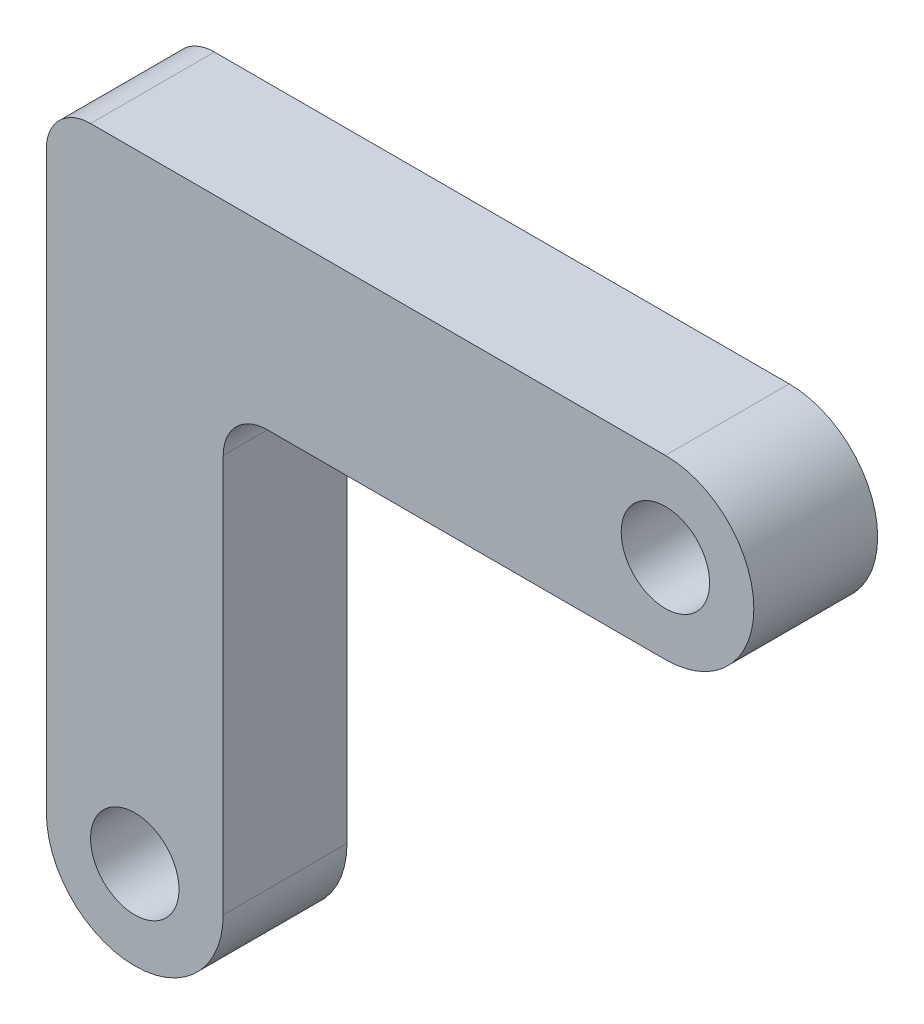
ISO-10303-21;
HEADER;
FILE_DESCRIPTION(('STEP AP214'),'2;1');
FILE_NAME('part.step','',(''),(''),'','','');
FILE_SCHEMA(('AUTOMOTIVE_DESIGN { 1 0 10303 214 1 1 1 1 }'));
ENDSEC;
DATA;
#1=APPLICATION_CONTEXT('core data for automotive mechanical design processes');
#2=APPLICATION_PROTOCOL_DEFINITION('international standard','automotive_design',2000,#1);
#3=PRODUCT_CONTEXT('',#1,'mechanical');
#4=PRODUCT('Part','Part','',(#3));
#5=PRODUCT_RELATED_PRODUCT_CATEGORY('part','',(#4));
#6=PRODUCT_DEFINITION_FORMATION('','',#4);
#7=PRODUCT_DEFINITION_CONTEXT('part definition',#1,'design');
#8=PRODUCT_DEFINITION('design','',#6,#7);
#9=PRODUCT_DEFINITION_SHAPE('','',#8);
#10=(LENGTH_UNIT() NAMED_UNIT(*) SI_UNIT(.MILLI.,.METRE.));
#11=(NAMED_UNIT(*) PLANE_ANGLE_UNIT() SI_UNIT($,.RADIAN.));
#12=(NAMED_UNIT(*) SI_UNIT($,.STERADIAN.) SOLID_ANGLE_UNIT());
#13=UNCERTAINTY_MEASURE_WITH_UNIT(LENGTH_MEASURE(1.E-05),#10,'distance_accuracy_value','');
#14=(GEOMETRIC_REPRESENTATION_CONTEXT(3) GLOBAL_UNCERTAINTY_ASSIGNED_CONTEXT((#13)) GLOBAL_UNIT_ASSIGNED_CONTEXT((#10,
#11,#12)) REPRESENTATION_CONTEXT('',''));
#15=CARTESIAN_POINT('',(0.,0.,0.));
#16=DIRECTION('',(0.,0.,1.));
#17=DIRECTION('',(1.,0.,0.));
#18=AXIS2_PLACEMENT_3D('',#15,#16,#17);
#19=CARTESIAN_POINT('',(1.08981308684975,0.712996389891696,2.8));
#20=DIRECTION('',(0.,0.,1.));
#21=DIRECTION('',(1.,0.,0.));
#22=AXIS2_PLACEMENT_3D('',#19,#20,#21);
#23=PLANE('',#22);
#24=CARTESIAN_POINT('',(13.0898130868497,12.7129963898917,2.8));
#25=DIRECTION('',(0.,0.,1.));
#26=DIRECTION('',(-1.,0.,0.));
#27=AXIS2_PLACEMENT_3D('',#24,#25,#26);
#28=CIRCLE('',#27,1.);
#29=CARTESIAN_POINT('',(12.0898130868497,12.7129963898917,2.8));
#30=VERTEX_POINT('',#29);
#31=EDGE_CURVE('E150',#30,#30,#28,.T.);
#32=ORIENTED_EDGE('',*,*,#31,.F.);
#33=EDGE_LOOP('',(#32));
#34=FACE_BOUND('',#33,.T.);
#35=DIRECTION('',(-1.,0.,0.));
#36=VECTOR('',#35,1.);
#37=CARTESIAN_POINT('',(13.0898130868497,14.7129963898917,2.8));
#38=LINE('',#37,#36);
#39=CARTESIAN_POINT('',(13.0898130868497,14.7129963898917,2.8));
#40=VERTEX_POINT('',#39);
#41=CARTESIAN_POINT('',(0.0898130868497455,14.7129963898917,2.8));
#42=VERTEX_POINT('',#41);
#43=EDGE_CURVE('E118',#40,#42,#38,.T.);
#44=ORIENTED_EDGE('',*,*,#43,.T.);
#45=CARTESIAN_POINT('',(0.0898130868497452,13.7129963898917,2.8));
#46=DIRECTION('',(0.,0.,1.));
#47=DIRECTION('',(1.,0.,0.));
#48=AXIS2_PLACEMENT_3D('',#45,#46,#47);
#49=CIRCLE('',#48,1.);
#50=CARTESIAN_POINT('',(-0.910186913150255,13.7129963898917,2.8));
#51=VERTEX_POINT('',#50);
#52=EDGE_CURVE('E113',#42,#51,#49,.T.);
#53=ORIENTED_EDGE('',*,*,#52,.T.);
#54=DIRECTION('',(0.,-1.,0.));
#55=VECTOR('',#54,1.);
#56=CARTESIAN_POINT('',(-0.910186913150254,0.712996389891696,2.8));
#57=LINE('',#56,#55);
#58=CARTESIAN_POINT('',(-0.910186913150254,0.712996389891696,2.8));
#59=VERTEX_POINT('',#58);
#60=EDGE_CURVE('E105',#51,#59,#57,.T.);
#61=ORIENTED_EDGE('',*,*,#60,.T.);
#62=CARTESIAN_POINT('',(1.08981308684975,0.712996389891696,2.8));
#63=DIRECTION('',(0.,0.,1.));
#64=DIRECTION('',(1.,0.,0.));
#65=AXIS2_PLACEMENT_3D('',#62,#63,#64);
#66=CIRCLE('',#65,2.);
#67=CARTESIAN_POINT('',(3.08981308684975,0.712996389891696,2.8));
#68=VERTEX_POINT('',#67);
#69=EDGE_CURVE('E110',#59,#68,#66,.T.);
#70=ORIENTED_EDGE('',*,*,#69,.T.);
#71=DIRECTION('',(0.,1.,0.));
#72=VECTOR('',#71,1.);
#73=CARTESIAN_POINT('',(3.08981308684974,10.7129963898917,2.8));
#74=LINE('',#73,#72);
#75=CARTESIAN_POINT('',(3.08981308684974,9.71299638989169,2.8));
#76=VERTEX_POINT('',#75);
#77=EDGE_CURVE('E134',#68,#76,#74,.T.);
#78=ORIENTED_EDGE('',*,*,#77,.T.);
#79=CARTESIAN_POINT('',(4.08981308684974,9.71299638989169,2.8));
#80=DIRECTION('',(0.,0.,1.));
#81=DIRECTION('',(1.,0.,0.));
#82=AXIS2_PLACEMENT_3D('',#79,#80,#81);
#83=CIRCLE('',#82,1.);
#84=CARTESIAN_POINT('',(4.08981308684974,10.7129963898917,2.8));
#85=VERTEX_POINT('',#84);
#86=EDGE_CURVE('E11',#76,#85,#83,.F.);
#87=ORIENTED_EDGE('',*,*,#86,.T.);
#88=DIRECTION('',(1.,0.,0.));
#89=VECTOR('',#88,1.);
#90=CARTESIAN_POINT('',(3.08981308684974,10.7129963898917,2.8));
#91=LINE('',#90,#89);
#92=CARTESIAN_POINT('',(13.0898130868497,10.7129963898917,2.8));
#93=VERTEX_POINT('',#92);
#94=EDGE_CURVE('E137',#85,#93,#91,.T.);
#95=ORIENTED_EDGE('',*,*,#94,.T.);
#96=CARTESIAN_POINT('',(13.0898130868497,12.7129963898917,2.8));
#97=DIRECTION('',(0.,0.,1.));
#98=DIRECTION('',(-1.,0.,0.));
#99=AXIS2_PLACEMENT_3D('',#96,#97,#98);
#100=CIRCLE('',#99,2.);
#101=EDGE_CURVE('E143',#93,#40,#100,.T.);
#102=ORIENTED_EDGE('',*,*,#101,.T.);
#103=EDGE_LOOP('',(#44,#53,#61,#70,#78,#87,#95,#102));
#104=FACE_BOUND('',#103,.T.);
#105=CARTESIAN_POINT('',(1.08981308684975,0.712996389891696,2.8));
#106=DIRECTION('',(0.,0.,1.));
#107=DIRECTION('',(1.,0.,0.));
#108=AXIS2_PLACEMENT_3D('',#105,#106,#107);
#109=CIRCLE('',#108,1.);
#110=CARTESIAN_POINT('',(2.08981308684975,0.712996389891696,2.8));
#111=VERTEX_POINT('',#110);
#112=EDGE_CURVE('E316',#111,#111,#109,.T.);
#113=ORIENTED_EDGE('',*,*,#112,.F.);
#114=EDGE_LOOP('',(#113));
#115=FACE_BOUND('',#114,.T.);
#116=ADVANCED_FACE('F39',(#34,#104,#115),#23,.T.);
#117=CARTESIAN_POINT('',(1.08981308684975,0.712996389891696,0.));
#118=DIRECTION('',(0.,0.,1.));
#119=DIRECTION('',(1.,0.,0.));
#120=AXIS2_PLACEMENT_3D('',#117,#118,#119);
#121=PLANE('',#120);
#122=DIRECTION('',(0.,-1.,0.));
#123=VECTOR('',#122,1.);
#124=CARTESIAN_POINT('',(-0.910186913150254,0.712996389891696,0.));
#125=LINE('',#124,#123);
#126=CARTESIAN_POINT('',(-0.910186913150255,13.7129963898917,0.));
#127=VERTEX_POINT('',#126);
#128=CARTESIAN_POINT('',(-0.910186913150254,0.712996389891696,0.));
#129=VERTEX_POINT('',#128);
#130=EDGE_CURVE('E123',#127,#129,#125,.T.);
#131=ORIENTED_EDGE('',*,*,#130,.F.);
#132=CARTESIAN_POINT('',(0.0898130868497452,13.7129963898917,0.));
#133=DIRECTION('',(0.,0.,1.));
#134=DIRECTION('',(1.,0.,0.));
#135=AXIS2_PLACEMENT_3D('',#132,#133,#134);
#136=CIRCLE('',#135,1.);
#137=CARTESIAN_POINT('',(0.0898130868497455,14.7129963898917,0.));
#138=VERTEX_POINT('',#137);
#139=EDGE_CURVE('E63',#127,#138,#136,.F.);
#140=ORIENTED_EDGE('',*,*,#139,.T.);
#141=DIRECTION('',(-1.,0.,0.));
#142=VECTOR('',#141,1.);
#143=CARTESIAN_POINT('',(13.0898130868497,14.7129963898917,0.));
#144=LINE('',#143,#142);
#145=CARTESIAN_POINT('',(13.0898130868497,14.7129963898917,0.));
#146=VERTEX_POINT('',#145);
#147=EDGE_CURVE('E147',#146,#138,#144,.T.);
#148=ORIENTED_EDGE('',*,*,#147,.F.);
#149=CARTESIAN_POINT('',(13.0898130868497,12.7129963898917,0.));
#150=DIRECTION('',(0.,0.,1.));
#151=DIRECTION('',(-1.,0.,0.));
#152=AXIS2_PLACEMENT_3D('',#149,#150,#151);
#153=CIRCLE('',#152,2.);
#154=CARTESIAN_POINT('',(13.0898130868497,10.7129963898917,0.));
#155=VERTEX_POINT('',#154);
#156=EDGE_CURVE('E163',#155,#146,#153,.T.);
#157=ORIENTED_EDGE('',*,*,#156,.F.);
#158=DIRECTION('',(1.,0.,0.));
#159=VECTOR('',#158,1.);
#160=CARTESIAN_POINT('',(3.08981308684974,10.7129963898917,0.));
#161=LINE('',#160,#159);
#162=CARTESIAN_POINT('',(4.08981308684974,10.7129963898917,0.));
#163=VERTEX_POINT('',#162);
#164=EDGE_CURVE('E160',#163,#155,#161,.T.);
#165=ORIENTED_EDGE('',*,*,#164,.F.);
#166=CARTESIAN_POINT('',(4.08981308684974,9.71299638989169,0.));
#167=DIRECTION('',(0.,0.,1.));
#168=DIRECTION('',(1.,0.,0.));
#169=AXIS2_PLACEMENT_3D('',#166,#167,#168);
#170=CIRCLE('',#169,1.);
#171=CARTESIAN_POINT('',(3.08981308684974,9.71299638989169,0.));
#172=VERTEX_POINT('',#171);
#173=EDGE_CURVE('E48',#163,#172,#170,.T.);
#174=ORIENTED_EDGE('',*,*,#173,.T.);
#175=DIRECTION('',(0.,1.,0.));
#176=VECTOR('',#175,1.);
#177=CARTESIAN_POINT('',(3.08981308684974,10.7129963898917,0.));
#178=LINE('',#177,#176);
#179=CARTESIAN_POINT('',(3.08981308684975,0.712996389891696,0.));
#180=VERTEX_POINT('',#179);
#181=EDGE_CURVE('E156',#180,#172,#178,.T.);
#182=ORIENTED_EDGE('',*,*,#181,.F.);
#183=CARTESIAN_POINT('',(1.08981308684975,0.712996389891696,0.));
#184=DIRECTION('',(0.,0.,1.));
#185=DIRECTION('',(1.,0.,0.));
#186=AXIS2_PLACEMENT_3D('',#183,#184,#185);
#187=CIRCLE('',#186,2.);
#188=EDGE_CURVE('E153',#129,#180,#187,.T.);
#189=ORIENTED_EDGE('',*,*,#188,.F.);
#190=EDGE_LOOP('',(#131,#140,#148,#157,#165,#174,#182,#189));
#191=FACE_BOUND('',#190,.T.);
#192=CARTESIAN_POINT('',(13.0898130868497,12.7129963898917,0.));
#193=DIRECTION('',(0.,0.,1.));
#194=DIRECTION('',(-1.,0.,0.));
#195=AXIS2_PLACEMENT_3D('',#192,#193,#194);
#196=CIRCLE('',#195,1.);
#197=CARTESIAN_POINT('',(12.0898130868497,12.7129963898917,0.));
#198=VERTEX_POINT('',#197);
#199=EDGE_CURVE('E324',#198,#198,#196,.T.);
#200=ORIENTED_EDGE('',*,*,#199,.T.);
#201=EDGE_LOOP('',(#200));
#202=FACE_BOUND('',#201,.T.);
#203=CARTESIAN_POINT('',(1.08981308684975,0.712996389891696,0.));
#204=DIRECTION('',(0.,0.,1.));
#205=DIRECTION('',(1.,0.,0.));
#206=AXIS2_PLACEMENT_3D('',#203,#204,#205);
#207=CIRCLE('',#206,1.);
#208=CARTESIAN_POINT('',(2.08981308684975,0.712996389891696,0.));
#209=VERTEX_POINT('',#208);
#210=EDGE_CURVE('E319',#209,#209,#207,.T.);
#211=ORIENTED_EDGE('',*,*,#210,.T.);
#212=EDGE_LOOP('',(#211));
#213=FACE_BOUND('',#212,.T.);
#214=ADVANCED_FACE('F192',(#191,#202,#213),#121,.F.);
#215=CARTESIAN_POINT('',(13.0898130868497,14.7129963898917,2.8));
#216=DIRECTION('',(0.,-1.,0.));
#217=DIRECTION('',(1.,0.,0.));
#218=AXIS2_PLACEMENT_3D('',#215,#216,#217);
#219=PLANE('',#218);
#220=ORIENTED_EDGE('',*,*,#147,.T.);
#221=DIRECTION('',(0.,0.,-1.));
#222=VECTOR('',#221,1.);
#223=CARTESIAN_POINT('',(0.0898130868497455,14.7129963898917,2.8));
#224=LINE('',#223,#222);
#225=EDGE_CURVE('E55',#138,#42,#224,.F.);
#226=ORIENTED_EDGE('',*,*,#225,.T.);
#227=ORIENTED_EDGE('',*,*,#43,.F.);
#228=DIRECTION('',(0.,0.,-1.));
#229=VECTOR('',#228,1.);
#230=CARTESIAN_POINT('',(13.0898130868497,14.7129963898917,2.8));
#231=LINE('',#230,#229);
#232=EDGE_CURVE('E146',#40,#146,#231,.T.);
#233=ORIENTED_EDGE('',*,*,#232,.T.);
#234=EDGE_LOOP('',(#220,#226,#227,#233));
#235=FACE_BOUND('',#234,.T.);
#236=ADVANCED_FACE('F223',(#235),#219,.F.);
#237=CARTESIAN_POINT('',(-0.910186913150254,0.712996389891696,2.8));
#238=DIRECTION('',(1.,0.,0.));
#239=DIRECTION('',(0.,1.,0.));
#240=AXIS2_PLACEMENT_3D('',#237,#238,#239);
#241=PLANE('',#240);
#242=ORIENTED_EDGE('',*,*,#60,.F.);
#243=DIRECTION('',(0.,0.,-1.));
#244=VECTOR('',#243,1.);
#245=CARTESIAN_POINT('',(-0.910186913150255,13.7129963898917,2.8));
#246=LINE('',#245,#244);
#247=EDGE_CURVE('E181',#51,#127,#246,.T.);
#248=ORIENTED_EDGE('',*,*,#247,.T.);
#249=ORIENTED_EDGE('',*,*,#130,.T.);
#250=DIRECTION('',(0.,0.,-1.));
#251=VECTOR('',#250,1.);
#252=CARTESIAN_POINT('',(-0.910186913150254,0.712996389891696,2.8));
#253=LINE('',#252,#251);
#254=EDGE_CURVE('E121',#59,#129,#253,.T.);
#255=ORIENTED_EDGE('',*,*,#254,.F.);
#256=EDGE_LOOP('',(#242,#248,#249,#255));
#257=FACE_BOUND('',#256,.T.);
#258=ADVANCED_FACE('F122',(#257),#241,.F.);
#259=CARTESIAN_POINT('',(1.08981308684975,0.712996389891696,2.8));
#260=DIRECTION('',(0.,0.,-1.));
#261=DIRECTION('',(-1.,0.,0.));
#262=AXIS2_PLACEMENT_3D('',#259,#260,#261);
#263=CYLINDRICAL_SURFACE('',#262,2.);
#264=ORIENTED_EDGE('',*,*,#188,.T.);
#265=DIRECTION('',(0.,0.,-1.));
#266=VECTOR('',#265,1.);
#267=CARTESIAN_POINT('',(3.08981308684975,0.712996389891696,2.8));
#268=LINE('',#267,#266);
#269=EDGE_CURVE('E128',#68,#180,#268,.T.);
#270=ORIENTED_EDGE('',*,*,#269,.F.);
#271=ORIENTED_EDGE('',*,*,#69,.F.);
#272=ORIENTED_EDGE('',*,*,#254,.T.);
#273=EDGE_LOOP('',(#264,#270,#271,#272));
#274=FACE_BOUND('',#273,.T.);
#275=ADVANCED_FACE('F130',(#274),#263,.T.);
#276=CARTESIAN_POINT('',(3.08981308684974,10.7129963898917,2.8));
#277=DIRECTION('',(-1.,0.,0.));
#278=DIRECTION('',(0.,-1.,0.));
#279=AXIS2_PLACEMENT_3D('',#276,#277,#278);
#280=PLANE('',#279);
#281=ORIENTED_EDGE('',*,*,#181,.T.);
#282=DIRECTION('',(0.,0.,-1.));
#283=VECTOR('',#282,1.);
#284=CARTESIAN_POINT('',(3.08981308684974,9.71299638989169,2.8));
#285=LINE('',#284,#283);
#286=EDGE_CURVE('E178',#172,#76,#285,.F.);
#287=ORIENTED_EDGE('',*,*,#286,.T.);
#288=ORIENTED_EDGE('',*,*,#77,.F.);
#289=ORIENTED_EDGE('',*,*,#269,.T.);
#290=EDGE_LOOP('',(#281,#287,#288,#289));
#291=FACE_BOUND('',#290,.T.);
#292=ADVANCED_FACE('F199',(#291),#280,.F.);
#293=CARTESIAN_POINT('',(3.08981308684974,10.7129963898917,2.8));
#294=DIRECTION('',(0.,1.,0.));
#295=DIRECTION('',(-1.,0.,0.));
#296=AXIS2_PLACEMENT_3D('',#293,#294,#295);
#297=PLANE('',#296);
#298=ORIENTED_EDGE('',*,*,#94,.F.);
#299=DIRECTION('',(0.,0.,-1.));
#300=VECTOR('',#299,1.);
#301=CARTESIAN_POINT('',(4.08981308684974,10.7129963898917,0.));
#302=LINE('',#301,#300);
#303=EDGE_CURVE('E127',#85,#163,#302,.T.);
#304=ORIENTED_EDGE('',*,*,#303,.T.);
#305=ORIENTED_EDGE('',*,*,#164,.T.);
#306=DIRECTION('',(0.,0.,-1.));
#307=VECTOR('',#306,1.);
#308=CARTESIAN_POINT('',(13.0898130868497,10.7129963898917,2.8));
#309=LINE('',#308,#307);
#310=EDGE_CURVE('E169',#93,#155,#309,.T.);
#311=ORIENTED_EDGE('',*,*,#310,.F.);
#312=EDGE_LOOP('',(#298,#304,#305,#311));
#313=FACE_BOUND('',#312,.T.);
#314=ADVANCED_FACE('F205',(#313),#297,.F.);
#315=CARTESIAN_POINT('',(13.0898130868497,12.7129963898917,2.8));
#316=DIRECTION('',(0.,0.,-1.));
#317=DIRECTION('',(-1.,0.,0.));
#318=AXIS2_PLACEMENT_3D('',#315,#316,#317);
#319=CYLINDRICAL_SURFACE('',#318,2.);
#320=ORIENTED_EDGE('',*,*,#156,.T.);
#321=ORIENTED_EDGE('',*,*,#232,.F.);
#322=ORIENTED_EDGE('',*,*,#101,.F.);
#323=ORIENTED_EDGE('',*,*,#310,.T.);
#324=EDGE_LOOP('',(#320,#321,#322,#323));
#325=FACE_BOUND('',#324,.T.);
#326=ADVANCED_FACE('F209',(#325),#319,.T.);
#327=CARTESIAN_POINT('',(13.0898130868497,12.7129963898917,2.8));
#328=DIRECTION('',(0.,0.,-1.));
#329=DIRECTION('',(-1.,0.,0.));
#330=AXIS2_PLACEMENT_3D('',#327,#328,#329);
#331=CYLINDRICAL_SURFACE('',#330,1.);
#332=ORIENTED_EDGE('',*,*,#31,.T.);
#333=EDGE_LOOP('',(#332));
#334=FACE_BOUND('',#333,.T.);
#335=ORIENTED_EDGE('',*,*,#199,.F.);
#336=EDGE_LOOP('',(#335));
#337=FACE_BOUND('',#336,.T.);
#338=ADVANCED_FACE('F227',(#334,#337),#331,.F.);
#339=CARTESIAN_POINT('',(1.08981308684975,0.712996389891696,2.8));
#340=DIRECTION('',(0.,0.,-1.));
#341=DIRECTION('',(-1.,0.,0.));
#342=AXIS2_PLACEMENT_3D('',#339,#340,#341);
#343=CYLINDRICAL_SURFACE('',#342,1.);
#344=ORIENTED_EDGE('',*,*,#112,.T.);
#345=EDGE_LOOP('',(#344));
#346=FACE_BOUND('',#345,.T.);
#347=ORIENTED_EDGE('',*,*,#210,.F.);
#348=EDGE_LOOP('',(#347));
#349=FACE_BOUND('',#348,.T.);
#350=ADVANCED_FACE('F216',(#346,#349),#343,.F.);
#351=CARTESIAN_POINT('',(4.08981308684974,9.71299638989169,2.8));
#352=DIRECTION('',(0.,0.,1.));
#353=DIRECTION('',(1.,0.,0.));
#354=AXIS2_PLACEMENT_3D('',#351,#352,#353);
#355=CYLINDRICAL_SURFACE('',#354,1.);
#356=ORIENTED_EDGE('',*,*,#86,.F.);
#357=ORIENTED_EDGE('',*,*,#286,.F.);
#358=ORIENTED_EDGE('',*,*,#173,.F.);
#359=ORIENTED_EDGE('',*,*,#303,.F.);
#360=EDGE_LOOP('',(#356,#357,#358,#359));
#361=FACE_BOUND('',#360,.T.);
#362=ADVANCED_FACE('F201',(#361),#355,.F.);
#363=CARTESIAN_POINT('',(0.0898130868497452,13.7129963898917,2.8));
#364=DIRECTION('',(0.,0.,-1.));
#365=DIRECTION('',(-1.,0.,0.));
#366=AXIS2_PLACEMENT_3D('',#363,#364,#365);
#367=CYLINDRICAL_SURFACE('',#366,1.);
#368=ORIENTED_EDGE('',*,*,#52,.F.);
#369=ORIENTED_EDGE('',*,*,#225,.F.);
#370=ORIENTED_EDGE('',*,*,#139,.F.);
#371=ORIENTED_EDGE('',*,*,#247,.F.);
#372=EDGE_LOOP('',(#368,#369,#370,#371));
#373=FACE_BOUND('',#372,.T.);
#374=ADVANCED_FACE('F41',(#373),#367,.T.);
#375=CLOSED_SHELL('',(#116,#214,#236,#258,#275,#292,#314,#326,#338,#350,#362,#374));
#376=MANIFOLD_SOLID_BREP('B2',#375);
#377=ADVANCED_BREP_SHAPE_REPRESENTATION('',(#18,#376),#14);
#378=SHAPE_DEFINITION_REPRESENTATION(#9,#377);
ENDSEC;
END-ISO-10303-21;
